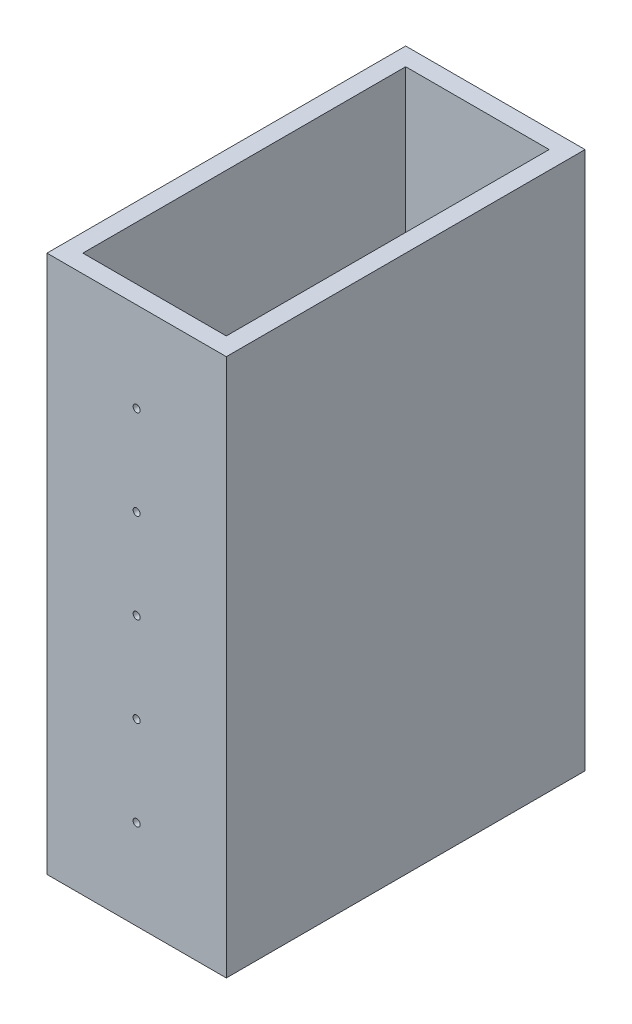
ISO-10303-21;
HEADER;
FILE_DESCRIPTION(('STEP AP214'),'2;1');
FILE_NAME('part.step','',(''),(''),'','','');
FILE_SCHEMA(('AUTOMOTIVE_DESIGN { 1 0 10303 214 1 1 1 1 }'));
ENDSEC;
DATA;
#1=APPLICATION_CONTEXT('core data for automotive mechanical design processes');
#2=APPLICATION_PROTOCOL_DEFINITION('international standard','automotive_design',2000,#1);
#3=PRODUCT_CONTEXT('',#1,'mechanical');
#4=PRODUCT('Part','Part','',(#3));
#5=PRODUCT_RELATED_PRODUCT_CATEGORY('part','',(#4));
#6=PRODUCT_DEFINITION_FORMATION('','',#4);
#7=PRODUCT_DEFINITION_CONTEXT('part definition',#1,'design');
#8=PRODUCT_DEFINITION('design','',#6,#7);
#9=PRODUCT_DEFINITION_SHAPE('','',#8);
#10=(LENGTH_UNIT() NAMED_UNIT(*) SI_UNIT(.MILLI.,.METRE.));
#11=(NAMED_UNIT(*) PLANE_ANGLE_UNIT() SI_UNIT($,.RADIAN.));
#12=(NAMED_UNIT(*) SI_UNIT($,.STERADIAN.) SOLID_ANGLE_UNIT());
#13=UNCERTAINTY_MEASURE_WITH_UNIT(LENGTH_MEASURE(1.E-05),#10,'distance_accuracy_value','');
#14=(GEOMETRIC_REPRESENTATION_CONTEXT(3) GLOBAL_UNCERTAINTY_ASSIGNED_CONTEXT((#13)) GLOBAL_UNIT_ASSIGNED_CONTEXT((#10,
#11,#12)) REPRESENTATION_CONTEXT('',''));
#15=CARTESIAN_POINT('',(0.,0.,0.));
#16=DIRECTION('',(0.,0.,1.));
#17=DIRECTION('',(1.,0.,0.));
#18=AXIS2_PLACEMENT_3D('',#15,#16,#17);
#19=CARTESIAN_POINT('',(0.,76.2,0.));
#20=DIRECTION('',(0.,-1.,0.));
#21=DIRECTION('',(0.,0.,-1.));
#22=AXIS2_PLACEMENT_3D('',#19,#20,#21);
#23=PLANE('',#22);
#24=DIRECTION('',(0.,0.,1.));
#25=VECTOR('',#24,1.);
#26=CARTESIAN_POINT('',(0.,76.2,0.));
#27=LINE('',#26,#25);
#28=CARTESIAN_POINT('',(0.,76.2,-50.8));
#29=VERTEX_POINT('',#28);
#30=CARTESIAN_POINT('',(0.,76.2,0.));
#31=VERTEX_POINT('',#30);
#32=EDGE_CURVE('E139',#29,#31,#27,.T.);
#33=ORIENTED_EDGE('',*,*,#32,.T.);
#34=DIRECTION('',(1.,0.,0.));
#35=VECTOR('',#34,1.);
#36=CARTESIAN_POINT('',(0.,76.2,0.));
#37=LINE('',#36,#35);
#38=CARTESIAN_POINT('',(25.4,76.2,0.));
#39=VERTEX_POINT('',#38);
#40=EDGE_CURVE('E142',#31,#39,#37,.T.);
#41=ORIENTED_EDGE('',*,*,#40,.T.);
#42=DIRECTION('',(0.,0.,-1.));
#43=VECTOR('',#42,1.);
#44=CARTESIAN_POINT('',(25.4,76.2,0.));
#45=LINE('',#44,#43);
#46=CARTESIAN_POINT('',(25.4,76.2,-50.8));
#47=VERTEX_POINT('',#46);
#48=EDGE_CURVE('E145',#39,#47,#45,.T.);
#49=ORIENTED_EDGE('',*,*,#48,.T.);
#50=DIRECTION('',(-1.,0.,0.));
#51=VECTOR('',#50,1.);
#52=CARTESIAN_POINT('',(0.,76.2,-50.8));
#53=LINE('',#52,#51);
#54=EDGE_CURVE('E147',#47,#29,#53,.T.);
#55=ORIENTED_EDGE('',*,*,#54,.T.);
#56=EDGE_LOOP('',(#33,#41,#49,#55));
#57=FACE_BOUND('',#56,.T.);
#58=DIRECTION('',(0.,0.,-1.));
#59=VECTOR('',#58,1.);
#60=CARTESIAN_POINT('',(22.86,76.2,-2.54));
#61=LINE('',#60,#59);
#62=CARTESIAN_POINT('',(22.86,76.2,-2.54));
#63=VERTEX_POINT('',#62);
#64=CARTESIAN_POINT('',(22.86,76.2,-48.26));
#65=VERTEX_POINT('',#64);
#66=EDGE_CURVE('E101',#63,#65,#61,.T.);
#67=ORIENTED_EDGE('',*,*,#66,.F.);
#68=DIRECTION('',(1.,0.,0.));
#69=VECTOR('',#68,1.);
#70=CARTESIAN_POINT('',(2.54,76.2,-2.54));
#71=LINE('',#70,#69);
#72=CARTESIAN_POINT('',(2.54,76.2,-2.54));
#73=VERTEX_POINT('',#72);
#74=EDGE_CURVE('E123',#73,#63,#71,.T.);
#75=ORIENTED_EDGE('',*,*,#74,.F.);
#76=DIRECTION('',(0.,0.,1.));
#77=VECTOR('',#76,1.);
#78=CARTESIAN_POINT('',(2.54,76.2,-2.54));
#79=LINE('',#78,#77);
#80=CARTESIAN_POINT('',(2.54,76.2,-48.26));
#81=VERTEX_POINT('',#80);
#82=EDGE_CURVE('E121',#81,#73,#79,.T.);
#83=ORIENTED_EDGE('',*,*,#82,.F.);
#84=DIRECTION('',(-1.,0.,0.));
#85=VECTOR('',#84,1.);
#86=CARTESIAN_POINT('',(2.54,76.2,-48.26));
#87=LINE('',#86,#85);
#88=EDGE_CURVE('E109',#65,#81,#87,.T.);
#89=ORIENTED_EDGE('',*,*,#88,.F.);
#90=EDGE_LOOP('',(#67,#75,#83,#89));
#91=FACE_BOUND('',#90,.T.);
#92=ADVANCED_FACE('F34',(#57,#91),#23,.F.);
#93=CARTESIAN_POINT('',(0.,0.,0.));
#94=DIRECTION('',(0.,-1.,0.));
#95=DIRECTION('',(0.,0.,-1.));
#96=AXIS2_PLACEMENT_3D('',#93,#94,#95);
#97=PLANE('',#96);
#98=DIRECTION('',(0.,0.,1.));
#99=VECTOR('',#98,1.);
#100=CARTESIAN_POINT('',(0.,0.,0.));
#101=LINE('',#100,#99);
#102=CARTESIAN_POINT('',(0.,0.,-50.8));
#103=VERTEX_POINT('',#102);
#104=CARTESIAN_POINT('',(0.,0.,0.));
#105=VERTEX_POINT('',#104);
#106=EDGE_CURVE('E117',#103,#105,#101,.T.);
#107=ORIENTED_EDGE('',*,*,#106,.F.);
#108=DIRECTION('',(-1.,0.,0.));
#109=VECTOR('',#108,1.);
#110=CARTESIAN_POINT('',(0.,0.,-50.8));
#111=LINE('',#110,#109);
#112=CARTESIAN_POINT('',(25.4,0.,-50.8));
#113=VERTEX_POINT('',#112);
#114=EDGE_CURVE('E143',#113,#103,#111,.T.);
#115=ORIENTED_EDGE('',*,*,#114,.F.);
#116=DIRECTION('',(0.,0.,-1.));
#117=VECTOR('',#116,1.);
#118=CARTESIAN_POINT('',(25.4,0.,0.));
#119=LINE('',#118,#117);
#120=CARTESIAN_POINT('',(25.4,0.,0.));
#121=VERTEX_POINT('',#120);
#122=EDGE_CURVE('E154',#121,#113,#119,.T.);
#123=ORIENTED_EDGE('',*,*,#122,.F.);
#124=DIRECTION('',(1.,0.,0.));
#125=VECTOR('',#124,1.);
#126=CARTESIAN_POINT('',(0.,0.,0.));
#127=LINE('',#126,#125);
#128=EDGE_CURVE('E152',#105,#121,#127,.T.);
#129=ORIENTED_EDGE('',*,*,#128,.F.);
#130=EDGE_LOOP('',(#107,#115,#123,#129));
#131=FACE_BOUND('',#130,.T.);
#132=DIRECTION('',(1.,0.,0.));
#133=VECTOR('',#132,1.);
#134=CARTESIAN_POINT('',(2.54,0.,-2.54));
#135=LINE('',#134,#133);
#136=CARTESIAN_POINT('',(2.54,0.,-2.54));
#137=VERTEX_POINT('',#136);
#138=CARTESIAN_POINT('',(22.86,0.,-2.54));
#139=VERTEX_POINT('',#138);
#140=EDGE_CURVE('E110',#137,#139,#135,.T.);
#141=ORIENTED_EDGE('',*,*,#140,.T.);
#142=DIRECTION('',(0.,0.,-1.));
#143=VECTOR('',#142,1.);
#144=CARTESIAN_POINT('',(22.86,0.,-2.54));
#145=LINE('',#144,#143);
#146=CARTESIAN_POINT('',(22.86,0.,-48.26));
#147=VERTEX_POINT('',#146);
#148=EDGE_CURVE('E59',#139,#147,#145,.T.);
#149=ORIENTED_EDGE('',*,*,#148,.T.);
#150=DIRECTION('',(-1.,0.,0.));
#151=VECTOR('',#150,1.);
#152=CARTESIAN_POINT('',(2.54,0.,-48.26));
#153=LINE('',#152,#151);
#154=CARTESIAN_POINT('',(2.54,0.,-48.26));
#155=VERTEX_POINT('',#154);
#156=EDGE_CURVE('E116',#147,#155,#153,.T.);
#157=ORIENTED_EDGE('',*,*,#156,.T.);
#158=DIRECTION('',(0.,0.,1.));
#159=VECTOR('',#158,1.);
#160=CARTESIAN_POINT('',(2.54,0.,-2.54));
#161=LINE('',#160,#159);
#162=EDGE_CURVE('E131',#155,#137,#161,.T.);
#163=ORIENTED_EDGE('',*,*,#162,.T.);
#164=EDGE_LOOP('',(#141,#149,#157,#163));
#165=FACE_BOUND('',#164,.T.);
#166=ADVANCED_FACE('F227',(#131,#165),#97,.T.);
#167=CARTESIAN_POINT('',(0.,76.2,0.));
#168=DIRECTION('',(1.,0.,0.));
#169=DIRECTION('',(0.,0.,-1.));
#170=AXIS2_PLACEMENT_3D('',#167,#168,#169);
#171=PLANE('',#170);
#172=ORIENTED_EDGE('',*,*,#106,.T.);
#173=DIRECTION('',(0.,-1.,0.));
#174=VECTOR('',#173,1.);
#175=CARTESIAN_POINT('',(0.,76.2,0.));
#176=LINE('',#175,#174);
#177=EDGE_CURVE('E11',#31,#105,#176,.T.);
#178=ORIENTED_EDGE('',*,*,#177,.F.);
#179=ORIENTED_EDGE('',*,*,#32,.F.);
#180=DIRECTION('',(0.,-1.,0.));
#181=VECTOR('',#180,1.);
#182=CARTESIAN_POINT('',(0.,76.2,-50.8));
#183=LINE('',#182,#181);
#184=EDGE_CURVE('E149',#29,#103,#183,.T.);
#185=ORIENTED_EDGE('',*,*,#184,.T.);
#186=EDGE_LOOP('',(#172,#178,#179,#185));
#187=FACE_BOUND('',#186,.T.);
#188=ADVANCED_FACE('F36',(#187),#171,.F.);
#189=CARTESIAN_POINT('',(0.,76.2,0.));
#190=DIRECTION('',(0.,0.,-1.));
#191=DIRECTION('',(-1.,0.,0.));
#192=AXIS2_PLACEMENT_3D('',#189,#190,#191);
#193=PLANE('',#192);
#194=CARTESIAN_POINT('',(12.7,12.7,0.));
#195=DIRECTION('',(0.,0.,-1.));
#196=DIRECTION('',(-1.,0.,0.));
#197=AXIS2_PLACEMENT_3D('',#194,#195,#196);
#198=CIRCLE('',#197,0.500000000000001);
#199=CARTESIAN_POINT('',(12.2,12.7,0.));
#200=VERTEX_POINT('',#199);
#201=EDGE_CURVE('E129',#200,#200,#198,.T.);
#202=ORIENTED_EDGE('',*,*,#201,.T.);
#203=EDGE_LOOP('',(#202));
#204=FACE_BOUND('',#203,.T.);
#205=CARTESIAN_POINT('',(12.7,25.4,0.));
#206=DIRECTION('',(0.,0.,-1.));
#207=DIRECTION('',(-1.,0.,0.));
#208=AXIS2_PLACEMENT_3D('',#205,#206,#207);
#209=CIRCLE('',#208,0.500000000000001);
#210=CARTESIAN_POINT('',(12.2,25.4,0.));
#211=VERTEX_POINT('',#210);
#212=EDGE_CURVE('E185',#211,#211,#209,.T.);
#213=ORIENTED_EDGE('',*,*,#212,.T.);
#214=EDGE_LOOP('',(#213));
#215=FACE_BOUND('',#214,.T.);
#216=CARTESIAN_POINT('',(12.7000000000001,38.1,0.));
#217=DIRECTION('',(0.,0.,-1.));
#218=DIRECTION('',(-1.,0.,0.));
#219=AXIS2_PLACEMENT_3D('',#216,#217,#218);
#220=CIRCLE('',#219,0.500000000000001);
#221=CARTESIAN_POINT('',(12.2000000000001,38.1,0.));
#222=VERTEX_POINT('',#221);
#223=EDGE_CURVE('E181',#222,#222,#220,.T.);
#224=ORIENTED_EDGE('',*,*,#223,.T.);
#225=EDGE_LOOP('',(#224));
#226=FACE_BOUND('',#225,.T.);
#227=CARTESIAN_POINT('',(12.7000000000001,50.8,0.));
#228=DIRECTION('',(0.,0.,-1.));
#229=DIRECTION('',(-1.,0.,0.));
#230=AXIS2_PLACEMENT_3D('',#227,#228,#229);
#231=CIRCLE('',#230,0.500000000000001);
#232=CARTESIAN_POINT('',(12.2000000000001,50.8,0.));
#233=VERTEX_POINT('',#232);
#234=EDGE_CURVE('E177',#233,#233,#231,.T.);
#235=ORIENTED_EDGE('',*,*,#234,.T.);
#236=EDGE_LOOP('',(#235));
#237=FACE_BOUND('',#236,.T.);
#238=CARTESIAN_POINT('',(12.7000000000002,63.5,0.));
#239=DIRECTION('',(0.,0.,-1.));
#240=DIRECTION('',(-1.,0.,0.));
#241=AXIS2_PLACEMENT_3D('',#238,#239,#240);
#242=CIRCLE('',#241,0.500000000000001);
#243=CARTESIAN_POINT('',(12.2000000000002,63.5,0.));
#244=VERTEX_POINT('',#243);
#245=EDGE_CURVE('E173',#244,#244,#242,.T.);
#246=ORIENTED_EDGE('',*,*,#245,.T.);
#247=EDGE_LOOP('',(#246));
#248=FACE_BOUND('',#247,.T.);
#249=ORIENTED_EDGE('',*,*,#128,.T.);
#250=DIRECTION('',(0.,-1.,0.));
#251=VECTOR('',#250,1.);
#252=CARTESIAN_POINT('',(25.4,76.2,0.));
#253=LINE('',#252,#251);
#254=EDGE_CURVE('E43',#39,#121,#253,.T.);
#255=ORIENTED_EDGE('',*,*,#254,.F.);
#256=ORIENTED_EDGE('',*,*,#40,.F.);
#257=ORIENTED_EDGE('',*,*,#177,.T.);
#258=EDGE_LOOP('',(#249,#255,#256,#257));
#259=FACE_BOUND('',#258,.T.);
#260=ADVANCED_FACE('F202',(#204,#215,#226,#237,#248,#259),#193,.F.);
#261=CARTESIAN_POINT('',(25.4,76.2,0.));
#262=DIRECTION('',(-1.,0.,0.));
#263=DIRECTION('',(0.,0.,1.));
#264=AXIS2_PLACEMENT_3D('',#261,#262,#263);
#265=PLANE('',#264);
#266=ORIENTED_EDGE('',*,*,#122,.T.);
#267=DIRECTION('',(0.,-1.,0.));
#268=VECTOR('',#267,1.);
#269=CARTESIAN_POINT('',(25.4,76.2,-50.8));
#270=LINE('',#269,#268);
#271=EDGE_CURVE('E159',#47,#113,#270,.T.);
#272=ORIENTED_EDGE('',*,*,#271,.F.);
#273=ORIENTED_EDGE('',*,*,#48,.F.);
#274=ORIENTED_EDGE('',*,*,#254,.T.);
#275=EDGE_LOOP('',(#266,#272,#273,#274));
#276=FACE_BOUND('',#275,.T.);
#277=ADVANCED_FACE('F241',(#276),#265,.F.);
#278=CARTESIAN_POINT('',(0.,76.2,-50.8));
#279=DIRECTION('',(0.,0.,1.));
#280=DIRECTION('',(1.,0.,0.));
#281=AXIS2_PLACEMENT_3D('',#278,#279,#280);
#282=PLANE('',#281);
#283=CARTESIAN_POINT('',(12.7,12.7,-50.8));
#284=DIRECTION('',(0.,0.,-1.));
#285=DIRECTION('',(-1.,0.,0.));
#286=AXIS2_PLACEMENT_3D('',#283,#284,#285);
#287=CIRCLE('',#286,0.500000000000001);
#288=CARTESIAN_POINT('',(12.2,12.7,-50.8));
#289=VERTEX_POINT('',#288);
#290=EDGE_CURVE('E168',#289,#289,#287,.T.);
#291=ORIENTED_EDGE('',*,*,#290,.F.);
#292=EDGE_LOOP('',(#291));
#293=FACE_BOUND('',#292,.T.);
#294=CARTESIAN_POINT('',(12.7,25.4,-50.8));
#295=DIRECTION('',(0.,0.,-1.));
#296=DIRECTION('',(-1.,0.,0.));
#297=AXIS2_PLACEMENT_3D('',#294,#295,#296);
#298=CIRCLE('',#297,0.500000000000001);
#299=CARTESIAN_POINT('',(12.2,25.4,-50.8));
#300=VERTEX_POINT('',#299);
#301=EDGE_CURVE('E331',#300,#300,#298,.T.);
#302=ORIENTED_EDGE('',*,*,#301,.F.);
#303=EDGE_LOOP('',(#302));
#304=FACE_BOUND('',#303,.T.);
#305=CARTESIAN_POINT('',(12.7000000000001,38.1,-50.8));
#306=DIRECTION('',(0.,0.,-1.));
#307=DIRECTION('',(-1.,0.,0.));
#308=AXIS2_PLACEMENT_3D('',#305,#306,#307);
#309=CIRCLE('',#308,0.500000000000001);
#310=CARTESIAN_POINT('',(12.2000000000001,38.1,-50.8));
#311=VERTEX_POINT('',#310);
#312=EDGE_CURVE('E329',#311,#311,#309,.T.);
#313=ORIENTED_EDGE('',*,*,#312,.F.);
#314=EDGE_LOOP('',(#313));
#315=FACE_BOUND('',#314,.T.);
#316=CARTESIAN_POINT('',(12.7000000000001,50.8,-50.8));
#317=DIRECTION('',(0.,0.,-1.));
#318=DIRECTION('',(-1.,0.,0.));
#319=AXIS2_PLACEMENT_3D('',#316,#317,#318);
#320=CIRCLE('',#319,0.500000000000001);
#321=CARTESIAN_POINT('',(12.2000000000001,50.8,-50.8));
#322=VERTEX_POINT('',#321);
#323=EDGE_CURVE('E327',#322,#322,#320,.T.);
#324=ORIENTED_EDGE('',*,*,#323,.F.);
#325=EDGE_LOOP('',(#324));
#326=FACE_BOUND('',#325,.T.);
#327=CARTESIAN_POINT('',(12.7000000000002,63.5,-50.8));
#328=DIRECTION('',(0.,0.,-1.));
#329=DIRECTION('',(-1.,0.,0.));
#330=AXIS2_PLACEMENT_3D('',#327,#328,#329);
#331=CIRCLE('',#330,0.500000000000001);
#332=CARTESIAN_POINT('',(12.2000000000002,63.5,-50.8));
#333=VERTEX_POINT('',#332);
#334=EDGE_CURVE('E302',#333,#333,#331,.T.);
#335=ORIENTED_EDGE('',*,*,#334,.F.);
#336=EDGE_LOOP('',(#335));
#337=FACE_BOUND('',#336,.T.);
#338=ORIENTED_EDGE('',*,*,#114,.T.);
#339=ORIENTED_EDGE('',*,*,#184,.F.);
#340=ORIENTED_EDGE('',*,*,#54,.F.);
#341=ORIENTED_EDGE('',*,*,#271,.T.);
#342=EDGE_LOOP('',(#338,#339,#340,#341));
#343=FACE_BOUND('',#342,.T.);
#344=ADVANCED_FACE('F238',(#293,#304,#315,#326,#337,#343),#282,.F.);
#345=CARTESIAN_POINT('',(22.86,76.2,-2.54));
#346=DIRECTION('',(-1.,0.,0.));
#347=DIRECTION('',(0.,0.,1.));
#348=AXIS2_PLACEMENT_3D('',#345,#346,#347);
#349=PLANE('',#348);
#350=ORIENTED_EDGE('',*,*,#148,.F.);
#351=DIRECTION('',(0.,-1.,0.));
#352=VECTOR('',#351,1.);
#353=CARTESIAN_POINT('',(22.86,76.2,-2.54));
#354=LINE('',#353,#352);
#355=EDGE_CURVE('E105',#63,#139,#354,.T.);
#356=ORIENTED_EDGE('',*,*,#355,.F.);
#357=ORIENTED_EDGE('',*,*,#66,.T.);
#358=DIRECTION('',(0.,-1.,0.));
#359=VECTOR('',#358,1.);
#360=CARTESIAN_POINT('',(22.86,76.2,-48.26));
#361=LINE('',#360,#359);
#362=EDGE_CURVE('E104',#65,#147,#361,.T.);
#363=ORIENTED_EDGE('',*,*,#362,.T.);
#364=EDGE_LOOP('',(#350,#356,#357,#363));
#365=FACE_BOUND('',#364,.T.);
#366=ADVANCED_FACE('F103',(#365),#349,.T.);
#367=CARTESIAN_POINT('',(2.54,76.2,-48.26));
#368=DIRECTION('',(0.,0.,1.));
#369=DIRECTION('',(1.,0.,0.));
#370=AXIS2_PLACEMENT_3D('',#367,#368,#369);
#371=PLANE('',#370);
#372=CARTESIAN_POINT('',(12.7,12.7,-48.26));
#373=DIRECTION('',(0.,0.,1.));
#374=DIRECTION('',(1.,0.,0.));
#375=AXIS2_PLACEMENT_3D('',#372,#373,#374);
#376=CIRCLE('',#375,0.500000000000001);
#377=CARTESIAN_POINT('',(13.2,12.7,-48.26));
#378=VERTEX_POINT('',#377);
#379=EDGE_CURVE('E197',#378,#378,#376,.T.);
#380=ORIENTED_EDGE('',*,*,#379,.F.);
#381=EDGE_LOOP('',(#380));
#382=FACE_BOUND('',#381,.T.);
#383=CARTESIAN_POINT('',(12.7,25.4,-48.26));
#384=DIRECTION('',(0.,0.,1.));
#385=DIRECTION('',(1.,0.,0.));
#386=AXIS2_PLACEMENT_3D('',#383,#384,#385);
#387=CIRCLE('',#386,0.500000000000001);
#388=CARTESIAN_POINT('',(13.2,25.4,-48.26));
#389=VERTEX_POINT('',#388);
#390=EDGE_CURVE('E180',#389,#389,#387,.T.);
#391=ORIENTED_EDGE('',*,*,#390,.F.);
#392=EDGE_LOOP('',(#391));
#393=FACE_BOUND('',#392,.T.);
#394=CARTESIAN_POINT('',(12.7000000000001,38.1,-48.26));
#395=DIRECTION('',(0.,0.,1.));
#396=DIRECTION('',(1.,0.,0.));
#397=AXIS2_PLACEMENT_3D('',#394,#395,#396);
#398=CIRCLE('',#397,0.500000000000001);
#399=CARTESIAN_POINT('',(13.2000000000001,38.1,-48.26));
#400=VERTEX_POINT('',#399);
#401=EDGE_CURVE('E176',#400,#400,#398,.T.);
#402=ORIENTED_EDGE('',*,*,#401,.F.);
#403=EDGE_LOOP('',(#402));
#404=FACE_BOUND('',#403,.T.);
#405=CARTESIAN_POINT('',(12.7000000000001,50.8,-48.26));
#406=DIRECTION('',(0.,0.,1.));
#407=DIRECTION('',(1.,0.,0.));
#408=AXIS2_PLACEMENT_3D('',#405,#406,#407);
#409=CIRCLE('',#408,0.500000000000001);
#410=CARTESIAN_POINT('',(13.2000000000001,50.8,-48.26));
#411=VERTEX_POINT('',#410);
#412=EDGE_CURVE('E172',#411,#411,#409,.T.);
#413=ORIENTED_EDGE('',*,*,#412,.F.);
#414=EDGE_LOOP('',(#413));
#415=FACE_BOUND('',#414,.T.);
#416=CARTESIAN_POINT('',(12.7000000000002,63.5,-48.26));
#417=DIRECTION('',(0.,0.,1.));
#418=DIRECTION('',(1.,0.,0.));
#419=AXIS2_PLACEMENT_3D('',#416,#417,#418);
#420=CIRCLE('',#419,0.500000000000001);
#421=CARTESIAN_POINT('',(13.2000000000002,63.5,-48.26));
#422=VERTEX_POINT('',#421);
#423=EDGE_CURVE('E167',#422,#422,#420,.T.);
#424=ORIENTED_EDGE('',*,*,#423,.F.);
#425=EDGE_LOOP('',(#424));
#426=FACE_BOUND('',#425,.T.);
#427=ORIENTED_EDGE('',*,*,#156,.F.);
#428=ORIENTED_EDGE('',*,*,#362,.F.);
#429=ORIENTED_EDGE('',*,*,#88,.T.);
#430=DIRECTION('',(0.,-1.,0.));
#431=VECTOR('',#430,1.);
#432=CARTESIAN_POINT('',(2.54,76.2,-48.26));
#433=LINE('',#432,#431);
#434=EDGE_CURVE('E118',#81,#155,#433,.T.);
#435=ORIENTED_EDGE('',*,*,#434,.T.);
#436=EDGE_LOOP('',(#427,#428,#429,#435));
#437=FACE_BOUND('',#436,.T.);
#438=ADVANCED_FACE('F113',(#382,#393,#404,#415,#426,#437),#371,.T.);
#439=CARTESIAN_POINT('',(2.54,76.2,-2.54));
#440=DIRECTION('',(1.,0.,0.));
#441=DIRECTION('',(0.,0.,-1.));
#442=AXIS2_PLACEMENT_3D('',#439,#440,#441);
#443=PLANE('',#442);
#444=ORIENTED_EDGE('',*,*,#162,.F.);
#445=ORIENTED_EDGE('',*,*,#434,.F.);
#446=ORIENTED_EDGE('',*,*,#82,.T.);
#447=DIRECTION('',(0.,-1.,0.));
#448=VECTOR('',#447,1.);
#449=CARTESIAN_POINT('',(2.54,76.2,-2.54));
#450=LINE('',#449,#448);
#451=EDGE_CURVE('E51',#73,#137,#450,.T.);
#452=ORIENTED_EDGE('',*,*,#451,.T.);
#453=EDGE_LOOP('',(#444,#445,#446,#452));
#454=FACE_BOUND('',#453,.T.);
#455=ADVANCED_FACE('F268',(#454),#443,.T.);
#456=CARTESIAN_POINT('',(2.54,76.2,-2.54));
#457=DIRECTION('',(0.,0.,-1.));
#458=DIRECTION('',(-1.,0.,0.));
#459=AXIS2_PLACEMENT_3D('',#456,#457,#458);
#460=PLANE('',#459);
#461=CARTESIAN_POINT('',(12.7,12.7,-2.54));
#462=DIRECTION('',(0.,0.,-1.));
#463=DIRECTION('',(-1.,0.,0.));
#464=AXIS2_PLACEMENT_3D('',#461,#462,#463);
#465=CIRCLE('',#464,0.500000000000001);
#466=CARTESIAN_POINT('',(12.2,12.7,-2.54));
#467=VERTEX_POINT('',#466);
#468=EDGE_CURVE('E38',#467,#467,#465,.T.);
#469=ORIENTED_EDGE('',*,*,#468,.F.);
#470=EDGE_LOOP('',(#469));
#471=FACE_BOUND('',#470,.T.);
#472=CARTESIAN_POINT('',(12.7,25.4,-2.54));
#473=DIRECTION('',(0.,0.,-1.));
#474=DIRECTION('',(-1.,0.,0.));
#475=AXIS2_PLACEMENT_3D('',#472,#473,#474);
#476=CIRCLE('',#475,0.500000000000001);
#477=CARTESIAN_POINT('',(12.2,25.4,-2.54));
#478=VERTEX_POINT('',#477);
#479=EDGE_CURVE('E178',#478,#478,#476,.T.);
#480=ORIENTED_EDGE('',*,*,#479,.F.);
#481=EDGE_LOOP('',(#480));
#482=FACE_BOUND('',#481,.T.);
#483=CARTESIAN_POINT('',(12.7000000000001,38.1,-2.54));
#484=DIRECTION('',(0.,0.,-1.));
#485=DIRECTION('',(-1.,0.,0.));
#486=AXIS2_PLACEMENT_3D('',#483,#484,#485);
#487=CIRCLE('',#486,0.500000000000001);
#488=CARTESIAN_POINT('',(12.2000000000001,38.1,-2.54));
#489=VERTEX_POINT('',#488);
#490=EDGE_CURVE('E174',#489,#489,#487,.T.);
#491=ORIENTED_EDGE('',*,*,#490,.F.);
#492=EDGE_LOOP('',(#491));
#493=FACE_BOUND('',#492,.T.);
#494=CARTESIAN_POINT('',(12.7000000000001,50.8,-2.54));
#495=DIRECTION('',(0.,0.,-1.));
#496=DIRECTION('',(-1.,0.,0.));
#497=AXIS2_PLACEMENT_3D('',#494,#495,#496);
#498=CIRCLE('',#497,0.500000000000001);
#499=CARTESIAN_POINT('',(12.2000000000001,50.8,-2.54));
#500=VERTEX_POINT('',#499);
#501=EDGE_CURVE('E169',#500,#500,#498,.T.);
#502=ORIENTED_EDGE('',*,*,#501,.F.);
#503=EDGE_LOOP('',(#502));
#504=FACE_BOUND('',#503,.T.);
#505=CARTESIAN_POINT('',(12.7000000000002,63.5,-2.54));
#506=DIRECTION('',(0.,0.,-1.));
#507=DIRECTION('',(-1.,0.,0.));
#508=AXIS2_PLACEMENT_3D('',#505,#506,#507);
#509=CIRCLE('',#508,0.500000000000001);
#510=CARTESIAN_POINT('',(12.2000000000002,63.5,-2.54));
#511=VERTEX_POINT('',#510);
#512=EDGE_CURVE('E164',#511,#511,#509,.T.);
#513=ORIENTED_EDGE('',*,*,#512,.F.);
#514=EDGE_LOOP('',(#513));
#515=FACE_BOUND('',#514,.T.);
#516=ORIENTED_EDGE('',*,*,#140,.F.);
#517=ORIENTED_EDGE('',*,*,#451,.F.);
#518=ORIENTED_EDGE('',*,*,#74,.T.);
#519=ORIENTED_EDGE('',*,*,#355,.T.);
#520=EDGE_LOOP('',(#516,#517,#518,#519));
#521=FACE_BOUND('',#520,.T.);
#522=ADVANCED_FACE('F266',(#471,#482,#493,#504,#515,#521),#460,.T.);
#523=CARTESIAN_POINT('',(12.7000000000002,63.5,25.4));
#524=DIRECTION('',(0.,0.,-1.));
#525=DIRECTION('',(-1.,0.,0.));
#526=AXIS2_PLACEMENT_3D('',#523,#524,#525);
#527=CYLINDRICAL_SURFACE('',#526,0.500000000000001);
#528=ORIENTED_EDGE('',*,*,#512,.T.);
#529=EDGE_LOOP('',(#528));
#530=FACE_BOUND('',#529,.T.);
#531=ORIENTED_EDGE('',*,*,#245,.F.);
#532=EDGE_LOOP('',(#531));
#533=FACE_BOUND('',#532,.T.);
#534=ADVANCED_FACE('F219',(#530,#533),#527,.F.);
#535=CARTESIAN_POINT('',(12.7000000000001,50.8,25.4));
#536=DIRECTION('',(0.,0.,-1.));
#537=DIRECTION('',(-1.,0.,0.));
#538=AXIS2_PLACEMENT_3D('',#535,#536,#537);
#539=CYLINDRICAL_SURFACE('',#538,0.500000000000001);
#540=ORIENTED_EDGE('',*,*,#501,.T.);
#541=EDGE_LOOP('',(#540));
#542=FACE_BOUND('',#541,.T.);
#543=ORIENTED_EDGE('',*,*,#234,.F.);
#544=EDGE_LOOP('',(#543));
#545=FACE_BOUND('',#544,.T.);
#546=ADVANCED_FACE('F275',(#542,#545),#539,.F.);
#547=CARTESIAN_POINT('',(12.7000000000001,38.1,25.4));
#548=DIRECTION('',(0.,0.,-1.));
#549=DIRECTION('',(-1.,0.,0.));
#550=AXIS2_PLACEMENT_3D('',#547,#548,#549);
#551=CYLINDRICAL_SURFACE('',#550,0.500000000000001);
#552=ORIENTED_EDGE('',*,*,#490,.T.);
#553=EDGE_LOOP('',(#552));
#554=FACE_BOUND('',#553,.T.);
#555=ORIENTED_EDGE('',*,*,#223,.F.);
#556=EDGE_LOOP('',(#555));
#557=FACE_BOUND('',#556,.T.);
#558=ADVANCED_FACE('F220',(#554,#557),#551,.F.);
#559=CARTESIAN_POINT('',(12.7,25.4,25.4));
#560=DIRECTION('',(0.,0.,-1.));
#561=DIRECTION('',(-1.,0.,0.));
#562=AXIS2_PLACEMENT_3D('',#559,#560,#561);
#563=CYLINDRICAL_SURFACE('',#562,0.500000000000001);
#564=ORIENTED_EDGE('',*,*,#479,.T.);
#565=EDGE_LOOP('',(#564));
#566=FACE_BOUND('',#565,.T.);
#567=ORIENTED_EDGE('',*,*,#212,.F.);
#568=EDGE_LOOP('',(#567));
#569=FACE_BOUND('',#568,.T.);
#570=ADVANCED_FACE('F208',(#566,#569),#563,.F.);
#571=CARTESIAN_POINT('',(12.7,12.7,25.4));
#572=DIRECTION('',(0.,0.,-1.));
#573=DIRECTION('',(-1.,0.,0.));
#574=AXIS2_PLACEMENT_3D('',#571,#572,#573);
#575=CYLINDRICAL_SURFACE('',#574,0.500000000000001);
#576=ORIENTED_EDGE('',*,*,#468,.T.);
#577=EDGE_LOOP('',(#576));
#578=FACE_BOUND('',#577,.T.);
#579=ORIENTED_EDGE('',*,*,#201,.F.);
#580=EDGE_LOOP('',(#579));
#581=FACE_BOUND('',#580,.T.);
#582=ADVANCED_FACE('F205',(#578,#581),#575,.F.);
#583=ORIENTED_EDGE('',*,*,#423,.T.);
#584=EDGE_LOOP('',(#583));
#585=FACE_BOUND('',#584,.T.);
#586=ORIENTED_EDGE('',*,*,#334,.T.);
#587=EDGE_LOOP('',(#586));
#588=FACE_BOUND('',#587,.T.);
#589=ADVANCED_FACE('F207',(#585,#588),#527,.F.);
#590=ORIENTED_EDGE('',*,*,#412,.T.);
#591=EDGE_LOOP('',(#590));
#592=FACE_BOUND('',#591,.T.);
#593=ORIENTED_EDGE('',*,*,#323,.T.);
#594=EDGE_LOOP('',(#593));
#595=FACE_BOUND('',#594,.T.);
#596=ADVANCED_FACE('F216',(#592,#595),#539,.F.);
#597=ORIENTED_EDGE('',*,*,#401,.T.);
#598=EDGE_LOOP('',(#597));
#599=FACE_BOUND('',#598,.T.);
#600=ORIENTED_EDGE('',*,*,#312,.T.);
#601=EDGE_LOOP('',(#600));
#602=FACE_BOUND('',#601,.T.);
#603=ADVANCED_FACE('F317',(#599,#602),#551,.F.);
#604=ORIENTED_EDGE('',*,*,#390,.T.);
#605=EDGE_LOOP('',(#604));
#606=FACE_BOUND('',#605,.T.);
#607=ORIENTED_EDGE('',*,*,#301,.T.);
#608=EDGE_LOOP('',(#607));
#609=FACE_BOUND('',#608,.T.);
#610=ADVANCED_FACE('F222',(#606,#609),#563,.F.);
#611=ORIENTED_EDGE('',*,*,#379,.T.);
#612=EDGE_LOOP('',(#611));
#613=FACE_BOUND('',#612,.T.);
#614=ORIENTED_EDGE('',*,*,#290,.T.);
#615=EDGE_LOOP('',(#614));
#616=FACE_BOUND('',#615,.T.);
#617=ADVANCED_FACE('F211',(#613,#616),#575,.F.);
#618=CLOSED_SHELL('',(#92,#166,#188,#260,#277,#344,#366,#438,#455,#522,#534,#546,#558,#570,#582,
#589,#596,#603,#610,#617));
#619=MANIFOLD_SOLID_BREP('B2',#618);
#620=ADVANCED_BREP_SHAPE_REPRESENTATION('',(#18,#619),#14);
#621=SHAPE_DEFINITION_REPRESENTATION(#9,#620);
ENDSEC;
END-ISO-10303-21;
